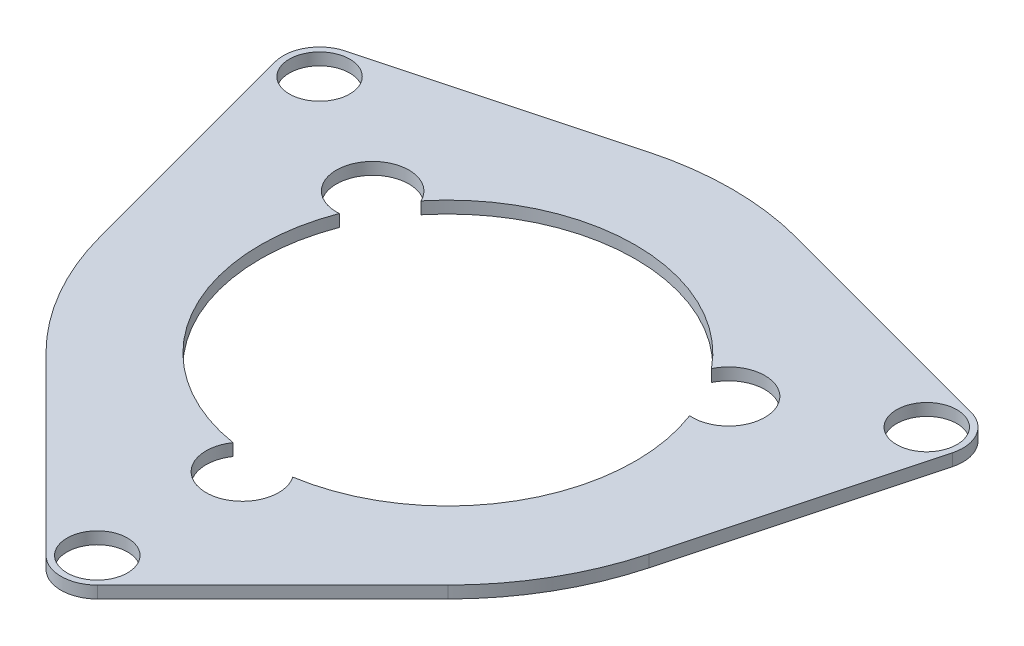
ISO-10303-21;
HEADER;
FILE_DESCRIPTION(('STEP AP214'),'2;1');
FILE_NAME('part.step','',(''),(''),'','','');
FILE_SCHEMA(('AUTOMOTIVE_DESIGN { 1 0 10303 214 1 1 1 1 }'));
ENDSEC;
DATA;
#1=APPLICATION_CONTEXT('core data for automotive mechanical design processes');
#2=APPLICATION_PROTOCOL_DEFINITION('international standard','automotive_design',2000,#1);
#3=PRODUCT_CONTEXT('',#1,'mechanical');
#4=PRODUCT('Part','Part','',(#3));
#5=PRODUCT_RELATED_PRODUCT_CATEGORY('part','',(#4));
#6=PRODUCT_DEFINITION_FORMATION('','',#4);
#7=PRODUCT_DEFINITION_CONTEXT('part definition',#1,'design');
#8=PRODUCT_DEFINITION('design','',#6,#7);
#9=PRODUCT_DEFINITION_SHAPE('','',#8);
#10=(LENGTH_UNIT() NAMED_UNIT(*) SI_UNIT(.MILLI.,.METRE.));
#11=(NAMED_UNIT(*) PLANE_ANGLE_UNIT() SI_UNIT($,.RADIAN.));
#12=(NAMED_UNIT(*) SI_UNIT($,.STERADIAN.) SOLID_ANGLE_UNIT());
#13=UNCERTAINTY_MEASURE_WITH_UNIT(LENGTH_MEASURE(1.E-05),#10,'distance_accuracy_value','');
#14=(GEOMETRIC_REPRESENTATION_CONTEXT(3) GLOBAL_UNCERTAINTY_ASSIGNED_CONTEXT((#13)) GLOBAL_UNIT_ASSIGNED_CONTEXT((#10,
#11,#12)) REPRESENTATION_CONTEXT('',''));
#15=CARTESIAN_POINT('',(0.,0.,0.));
#16=DIRECTION('',(0.,0.,1.));
#17=DIRECTION('',(1.,0.,0.));
#18=AXIS2_PLACEMENT_3D('',#15,#16,#17);
#19=CARTESIAN_POINT('',(0.,0.5,0.));
#20=DIRECTION('',(0.,-1.,0.));
#21=DIRECTION('',(0.,0.,-1.));
#22=AXIS2_PLACEMENT_3D('',#19,#20,#21);
#23=PLANE('',#22);
#24=CARTESIAN_POINT('',(0.,0.5,14.4999999999999));
#25=DIRECTION('',(0.,1.,0.));
#26=DIRECTION('',(0.,0.,1.));
#27=AXIS2_PLACEMENT_3D('',#24,#25,#26);
#28=CIRCLE('',#27,1.25);
#29=CARTESIAN_POINT('',(0.,0.5,15.7499999999999));
#30=VERTEX_POINT('',#29);
#31=EDGE_CURVE('E206',#30,#30,#28,.T.);
#32=ORIENTED_EDGE('',*,*,#31,.F.);
#33=EDGE_LOOP('',(#32));
#34=FACE_BOUND('',#33,.T.);
#35=CARTESIAN_POINT('',(-12.5573683548744,0.5,-7.24999999999988));
#36=DIRECTION('',(0.,1.,0.));
#37=DIRECTION('',(0.,0.,1.));
#38=AXIS2_PLACEMENT_3D('',#35,#36,#37);
#39=CIRCLE('',#38,1.25);
#40=CARTESIAN_POINT('',(-12.5573683548744,0.5,-5.99999999999989));
#41=VERTEX_POINT('',#40);
#42=EDGE_CURVE('E218',#41,#41,#39,.T.);
#43=ORIENTED_EDGE('',*,*,#42,.F.);
#44=EDGE_LOOP('',(#43));
#45=FACE_BOUND('',#44,.T.);
#46=CARTESIAN_POINT('',(0.,0.5,0.));
#47=DIRECTION('',(0.,1.,0.));
#48=DIRECTION('',(0.,0.,-1.));
#49=AXIS2_PLACEMENT_3D('',#46,#47,#48);
#50=CIRCLE('',#49,11.753048327205);
#51=CARTESIAN_POINT('',(3.0419127450911,0.5,-11.3525729168708));
#52=VERTEX_POINT('',#51);
#53=CARTESIAN_POINT('',(-3.0419127450911,0.5,-11.3525729168708));
#54=VERTEX_POINT('',#53);
#55=EDGE_CURVE('E224',#52,#54,#50,.T.);
#56=ORIENTED_EDGE('',*,*,#55,.T.);
#57=DIRECTION('',(-0.965925826289065,0.,0.258819045102533));
#58=VECTOR('',#57,1.);
#59=CARTESIAN_POINT('',(-3.0419127450911,0.5,-11.3525729168708));
#60=LINE('',#59,#58);
#61=CARTESIAN_POINT('',(-12.9455969225282,0.5,-8.69888873943348));
#62=VERTEX_POINT('',#61);
#63=EDGE_CURVE('E227',#54,#62,#60,.T.);
#64=ORIENTED_EDGE('',*,*,#63,.T.);
#65=CARTESIAN_POINT('',(-12.5573683548744,0.5,-7.24999999999988));
#66=DIRECTION('',(0.,1.,0.));
#67=DIRECTION('',(0.,0.,-1.));
#68=AXIS2_PLACEMENT_3D('',#65,#66,#67);
#69=CIRCLE('',#68,1.5);
#70=CARTESIAN_POINT('',(-14.006257094308,0.5,-6.86177143234609));
#71=VERTEX_POINT('',#70);
#72=EDGE_CURVE('E230',#62,#71,#69,.T.);
#73=ORIENTED_EDGE('',*,*,#72,.T.);
#74=DIRECTION('',(0.258819045102528,0.,0.965925826289066));
#75=VECTOR('',#74,1.);
#76=CARTESIAN_POINT('',(-11.3525729168708,0.5,3.04191274509105));
#77=LINE('',#76,#75);
#78=CARTESIAN_POINT('',(-11.3525729168708,0.5,3.04191274509105));
#79=VERTEX_POINT('',#78);
#80=EDGE_CURVE('E232',#71,#79,#77,.T.);
#81=ORIENTED_EDGE('',*,*,#80,.T.);
#82=CARTESIAN_POINT('',(0.,0.5,0.));
#83=DIRECTION('',(0.,1.,0.));
#84=DIRECTION('',(0.,0.,1.));
#85=AXIS2_PLACEMENT_3D('',#82,#83,#84);
#86=CIRCLE('',#85,11.753048327205);
#87=CARTESIAN_POINT('',(-8.31066017177983,0.5,8.31066017177985));
#88=VERTEX_POINT('',#87);
#89=EDGE_CURVE('E234',#79,#88,#86,.T.);
#90=ORIENTED_EDGE('',*,*,#89,.T.);
#91=DIRECTION('',(0.707106781186549,0.,0.707106781186546));
#92=VECTOR('',#91,1.);
#93=CARTESIAN_POINT('',(-8.31066017177982,0.5,8.31066017177985));
#94=LINE('',#93,#92);
#95=CARTESIAN_POINT('',(-1.06066017177982,0.5,15.5606601717798));
#96=VERTEX_POINT('',#95);
#97=EDGE_CURVE('E236',#88,#96,#94,.T.);
#98=ORIENTED_EDGE('',*,*,#97,.T.);
#99=CARTESIAN_POINT('',(0.,0.5,14.4999999999999));
#100=DIRECTION('',(0.,1.,0.));
#101=DIRECTION('',(0.,0.,1.));
#102=AXIS2_PLACEMENT_3D('',#99,#100,#101);
#103=CIRCLE('',#102,1.50000000000005);
#104=CARTESIAN_POINT('',(1.06066017177982,0.5,15.5606601717798));
#105=VERTEX_POINT('',#104);
#106=EDGE_CURVE('E238',#96,#105,#103,.T.);
#107=ORIENTED_EDGE('',*,*,#106,.T.);
#108=DIRECTION('',(0.707106781186548,0.,-0.707106781186547));
#109=VECTOR('',#108,1.);
#110=CARTESIAN_POINT('',(8.31066017177982,0.5,8.31066017177985));
#111=LINE('',#110,#109);
#112=CARTESIAN_POINT('',(8.31066017177982,0.5,8.31066017177985));
#113=VERTEX_POINT('',#112);
#114=EDGE_CURVE('E240',#105,#113,#111,.T.);
#115=ORIENTED_EDGE('',*,*,#114,.T.);
#116=CARTESIAN_POINT('',(0.,0.5,0.));
#117=DIRECTION('',(0.,1.,0.));
#118=DIRECTION('',(0.,0.,-1.));
#119=AXIS2_PLACEMENT_3D('',#116,#117,#118);
#120=CIRCLE('',#119,11.753048327205);
#121=CARTESIAN_POINT('',(11.3525729168708,0.5,3.04191274509105));
#122=VERTEX_POINT('',#121);
#123=EDGE_CURVE('E242',#113,#122,#120,.T.);
#124=ORIENTED_EDGE('',*,*,#123,.T.);
#125=DIRECTION('',(0.258819045102527,0.,-0.965925826289067));
#126=VECTOR('',#125,1.);
#127=CARTESIAN_POINT('',(11.3525729168708,0.5,3.04191274509105));
#128=LINE('',#127,#126);
#129=CARTESIAN_POINT('',(14.006257094308,0.5,-6.8617714323461));
#130=VERTEX_POINT('',#129);
#131=EDGE_CURVE('E244',#122,#130,#128,.T.);
#132=ORIENTED_EDGE('',*,*,#131,.T.);
#133=CARTESIAN_POINT('',(12.5573683548744,0.5,-7.24999999999991));
#134=DIRECTION('',(0.,1.,0.));
#135=DIRECTION('',(0.,0.,-1.));
#136=AXIS2_PLACEMENT_3D('',#133,#134,#135);
#137=CIRCLE('',#136,1.49999999999999);
#138=CARTESIAN_POINT('',(12.9455969225282,0.5,-8.69888873943349));
#139=VERTEX_POINT('',#138);
#140=EDGE_CURVE('E246',#130,#139,#137,.T.);
#141=ORIENTED_EDGE('',*,*,#140,.T.);
#142=DIRECTION('',(-0.965925826289065,0.,-0.258819045102532));
#143=VECTOR('',#142,1.);
#144=CARTESIAN_POINT('',(3.0419127450911,0.5,-11.3525729168708));
#145=LINE('',#144,#143);
#146=EDGE_CURVE('E248',#139,#52,#145,.T.);
#147=ORIENTED_EDGE('',*,*,#146,.T.);
#148=EDGE_LOOP('',(#56,#64,#73,#81,#90,#98,#107,#115,#124,#132,#141,#147));
#149=FACE_BOUND('',#148,.T.);
#150=CARTESIAN_POINT('',(12.5573683548744,0.5,-7.24999999999991));
#151=DIRECTION('',(0.,1.,0.));
#152=DIRECTION('',(0.,0.,1.));
#153=AXIS2_PLACEMENT_3D('',#150,#151,#152);
#154=CIRCLE('',#153,1.25);
#155=CARTESIAN_POINT('',(12.5573683548744,0.5,-5.99999999999991));
#156=VERTEX_POINT('',#155);
#157=EDGE_CURVE('E212',#156,#156,#154,.T.);
#158=ORIENTED_EDGE('',*,*,#157,.F.);
#159=EDGE_LOOP('',(#158));
#160=FACE_BOUND('',#159,.T.);
#161=CARTESIAN_POINT('',(0.,0.5,0.));
#162=DIRECTION('',(0.,1.,0.));
#163=DIRECTION('',(0.,0.,-1.));
#164=AXIS2_PLACEMENT_3D('',#161,#162,#163);
#165=CIRCLE('',#164,7.75);
#166=CARTESIAN_POINT('',(6.00751808071081,0.5,-4.89614404505553));
#167=VERTEX_POINT('',#166);
#168=CARTESIAN_POINT('',(-6.00751808071081,0.5,-4.89614404505553));
#169=VERTEX_POINT('',#168);
#170=EDGE_CURVE('E155',#167,#169,#165,.T.);
#171=ORIENTED_EDGE('',*,*,#170,.F.);
#172=CARTESIAN_POINT('',(7.36121593216777,0.5,-4.24999999999993));
#173=DIRECTION('',(0.,1.,0.));
#174=DIRECTION('',(0.,0.,-1.));
#175=AXIS2_PLACEMENT_3D('',#172,#173,#174);
#176=CIRCLE('',#175,1.5);
#177=CARTESIAN_POINT('',(7.24394416396144,0.5,-2.754591249062));
#178=VERTEX_POINT('',#177);
#179=EDGE_CURVE('E184',#178,#167,#176,.T.);
#180=ORIENTED_EDGE('',*,*,#179,.F.);
#181=CARTESIAN_POINT('',(0.,0.5,0.));
#182=DIRECTION('',(0.,1.,0.));
#183=DIRECTION('',(0.,0.,-1.));
#184=AXIS2_PLACEMENT_3D('',#181,#182,#183);
#185=CIRCLE('',#184,7.75);
#186=CARTESIAN_POINT('',(1.23642608325066,0.5,7.65073529411765));
#187=VERTEX_POINT('',#186);
#188=EDGE_CURVE('E182',#187,#178,#185,.T.);
#189=ORIENTED_EDGE('',*,*,#188,.F.);
#190=CARTESIAN_POINT('',(0.,0.5,8.5));
#191=DIRECTION('',(0.,1.,0.));
#192=DIRECTION('',(0.,0.,-1.));
#193=AXIS2_PLACEMENT_3D('',#190,#191,#192);
#194=CIRCLE('',#193,1.5);
#195=CARTESIAN_POINT('',(-1.23642608325065,0.5,7.65073529411765));
#196=VERTEX_POINT('',#195);
#197=EDGE_CURVE('E178',#196,#187,#194,.T.);
#198=ORIENTED_EDGE('',*,*,#197,.F.);
#199=CARTESIAN_POINT('',(0.,0.5,0.));
#200=DIRECTION('',(0.,1.,0.));
#201=DIRECTION('',(0.,0.,-1.));
#202=AXIS2_PLACEMENT_3D('',#199,#200,#201);
#203=CIRCLE('',#202,7.75);
#204=CARTESIAN_POINT('',(-7.24394416396144,0.5,-2.75459124906199));
#205=VERTEX_POINT('',#204);
#206=EDGE_CURVE('E176',#205,#196,#203,.T.);
#207=ORIENTED_EDGE('',*,*,#206,.F.);
#208=CARTESIAN_POINT('',(-7.36121593216777,0.5,-4.24999999999993));
#209=DIRECTION('',(0.,1.,0.));
#210=DIRECTION('',(0.,0.,-1.));
#211=AXIS2_PLACEMENT_3D('',#208,#209,#210);
#212=CIRCLE('',#211,1.5);
#213=EDGE_CURVE('E163',#169,#205,#212,.T.);
#214=ORIENTED_EDGE('',*,*,#213,.F.);
#215=EDGE_LOOP('',(#171,#180,#189,#198,#207,#214));
#216=FACE_BOUND('',#215,.T.);
#217=ADVANCED_FACE('F30',(#34,#45,#149,#160,#216),#23,.F.);
#218=CARTESIAN_POINT('',(0.,0.,0.));
#219=DIRECTION('',(0.,-1.,0.));
#220=DIRECTION('',(0.,0.,-1.));
#221=AXIS2_PLACEMENT_3D('',#218,#219,#220);
#222=PLANE('',#221);
#223=CARTESIAN_POINT('',(0.,0.,14.4999999999999));
#224=DIRECTION('',(0.,1.,0.));
#225=DIRECTION('',(0.,0.,1.));
#226=AXIS2_PLACEMENT_3D('',#223,#224,#225);
#227=CIRCLE('',#226,1.25);
#228=CARTESIAN_POINT('',(0.,0.,15.7499999999999));
#229=VERTEX_POINT('',#228);
#230=EDGE_CURVE('E171',#229,#229,#227,.T.);
#231=ORIENTED_EDGE('',*,*,#230,.T.);
#232=EDGE_LOOP('',(#231));
#233=FACE_BOUND('',#232,.T.);
#234=CARTESIAN_POINT('',(-12.5573683548744,0.,-7.24999999999988));
#235=DIRECTION('',(0.,1.,0.));
#236=DIRECTION('',(0.,0.,1.));
#237=AXIS2_PLACEMENT_3D('',#234,#235,#236);
#238=CIRCLE('',#237,1.25);
#239=CARTESIAN_POINT('',(-12.5573683548744,0.,-5.99999999999989));
#240=VERTEX_POINT('',#239);
#241=EDGE_CURVE('E215',#240,#240,#238,.T.);
#242=ORIENTED_EDGE('',*,*,#241,.T.);
#243=EDGE_LOOP('',(#242));
#244=FACE_BOUND('',#243,.T.);
#245=CARTESIAN_POINT('',(0.,0.,0.));
#246=DIRECTION('',(0.,1.,0.));
#247=DIRECTION('',(0.,0.,-1.));
#248=AXIS2_PLACEMENT_3D('',#245,#246,#247);
#249=CIRCLE('',#248,11.753048327205);
#250=CARTESIAN_POINT('',(3.0419127450911,0.,-11.3525729168708));
#251=VERTEX_POINT('',#250);
#252=CARTESIAN_POINT('',(-3.0419127450911,0.,-11.3525729168708));
#253=VERTEX_POINT('',#252);
#254=EDGE_CURVE('E221',#251,#253,#249,.T.);
#255=ORIENTED_EDGE('',*,*,#254,.F.);
#256=DIRECTION('',(-0.965925826289065,0.,-0.258819045102532));
#257=VECTOR('',#256,1.);
#258=CARTESIAN_POINT('',(3.0419127450911,0.,-11.3525729168708));
#259=LINE('',#258,#257);
#260=CARTESIAN_POINT('',(12.9455969225282,0.,-8.69888873943349));
#261=VERTEX_POINT('',#260);
#262=EDGE_CURVE('E228',#261,#251,#259,.T.);
#263=ORIENTED_EDGE('',*,*,#262,.F.);
#264=CARTESIAN_POINT('',(12.5573683548744,0.,-7.24999999999991));
#265=DIRECTION('',(0.,1.,0.));
#266=DIRECTION('',(0.,0.,-1.));
#267=AXIS2_PLACEMENT_3D('',#264,#265,#266);
#268=CIRCLE('',#267,1.49999999999999);
#269=CARTESIAN_POINT('',(14.006257094308,0.,-6.8617714323461));
#270=VERTEX_POINT('',#269);
#271=EDGE_CURVE('E271',#270,#261,#268,.T.);
#272=ORIENTED_EDGE('',*,*,#271,.F.);
#273=DIRECTION('',(0.258819045102527,0.,-0.965925826289067));
#274=VECTOR('',#273,1.);
#275=CARTESIAN_POINT('',(11.3525729168708,0.,3.04191274509105));
#276=LINE('',#275,#274);
#277=CARTESIAN_POINT('',(11.3525729168708,0.,3.04191274509105));
#278=VERTEX_POINT('',#277);
#279=EDGE_CURVE('E269',#278,#270,#276,.T.);
#280=ORIENTED_EDGE('',*,*,#279,.F.);
#281=CARTESIAN_POINT('',(0.,0.,0.));
#282=DIRECTION('',(0.,1.,0.));
#283=DIRECTION('',(0.,0.,-1.));
#284=AXIS2_PLACEMENT_3D('',#281,#282,#283);
#285=CIRCLE('',#284,11.753048327205);
#286=CARTESIAN_POINT('',(8.31066017177982,0.,8.31066017177985));
#287=VERTEX_POINT('',#286);
#288=EDGE_CURVE('E267',#287,#278,#285,.T.);
#289=ORIENTED_EDGE('',*,*,#288,.F.);
#290=DIRECTION('',(0.707106781186548,0.,-0.707106781186547));
#291=VECTOR('',#290,1.);
#292=CARTESIAN_POINT('',(8.31066017177982,0.,8.31066017177985));
#293=LINE('',#292,#291);
#294=CARTESIAN_POINT('',(1.06066017177982,0.,15.5606601717798));
#295=VERTEX_POINT('',#294);
#296=EDGE_CURVE('E265',#295,#287,#293,.T.);
#297=ORIENTED_EDGE('',*,*,#296,.F.);
#298=CARTESIAN_POINT('',(0.,0.,14.4999999999999));
#299=DIRECTION('',(0.,1.,0.));
#300=DIRECTION('',(0.,0.,1.));
#301=AXIS2_PLACEMENT_3D('',#298,#299,#300);
#302=CIRCLE('',#301,1.50000000000005);
#303=CARTESIAN_POINT('',(-1.06066017177982,0.,15.5606601717798));
#304=VERTEX_POINT('',#303);
#305=EDGE_CURVE('E263',#304,#295,#302,.T.);
#306=ORIENTED_EDGE('',*,*,#305,.F.);
#307=DIRECTION('',(0.707106781186549,0.,0.707106781186546));
#308=VECTOR('',#307,1.);
#309=CARTESIAN_POINT('',(-8.31066017177982,0.,8.31066017177985));
#310=LINE('',#309,#308);
#311=CARTESIAN_POINT('',(-8.31066017177983,0.,8.31066017177985));
#312=VERTEX_POINT('',#311);
#313=EDGE_CURVE('E261',#312,#304,#310,.T.);
#314=ORIENTED_EDGE('',*,*,#313,.F.);
#315=CARTESIAN_POINT('',(0.,0.,0.));
#316=DIRECTION('',(0.,1.,0.));
#317=DIRECTION('',(0.,0.,1.));
#318=AXIS2_PLACEMENT_3D('',#315,#316,#317);
#319=CIRCLE('',#318,11.753048327205);
#320=CARTESIAN_POINT('',(-11.3525729168708,0.,3.04191274509105));
#321=VERTEX_POINT('',#320);
#322=EDGE_CURVE('E259',#321,#312,#319,.T.);
#323=ORIENTED_EDGE('',*,*,#322,.F.);
#324=DIRECTION('',(0.258819045102528,0.,0.965925826289066));
#325=VECTOR('',#324,1.);
#326=CARTESIAN_POINT('',(-11.3525729168708,0.,3.04191274509105));
#327=LINE('',#326,#325);
#328=CARTESIAN_POINT('',(-14.006257094308,0.,-6.86177143234609));
#329=VERTEX_POINT('',#328);
#330=EDGE_CURVE('E257',#329,#321,#327,.T.);
#331=ORIENTED_EDGE('',*,*,#330,.F.);
#332=CARTESIAN_POINT('',(-12.5573683548744,0.,-7.24999999999988));
#333=DIRECTION('',(0.,1.,0.));
#334=DIRECTION('',(0.,0.,-1.));
#335=AXIS2_PLACEMENT_3D('',#332,#333,#334);
#336=CIRCLE('',#335,1.5);
#337=CARTESIAN_POINT('',(-12.9455969225282,0.,-8.69888873943348));
#338=VERTEX_POINT('',#337);
#339=EDGE_CURVE('E255',#338,#329,#336,.T.);
#340=ORIENTED_EDGE('',*,*,#339,.F.);
#341=DIRECTION('',(-0.965925826289065,0.,0.258819045102533));
#342=VECTOR('',#341,1.);
#343=CARTESIAN_POINT('',(-3.0419127450911,0.,-11.3525729168708));
#344=LINE('',#343,#342);
#345=EDGE_CURVE('E253',#253,#338,#344,.T.);
#346=ORIENTED_EDGE('',*,*,#345,.F.);
#347=EDGE_LOOP('',(#255,#263,#272,#280,#289,#297,#306,#314,#323,#331,#340,#346));
#348=FACE_BOUND('',#347,.T.);
#349=CARTESIAN_POINT('',(12.5573683548744,0.,-7.24999999999991));
#350=DIRECTION('',(0.,1.,0.));
#351=DIRECTION('',(0.,0.,1.));
#352=AXIS2_PLACEMENT_3D('',#349,#350,#351);
#353=CIRCLE('',#352,1.25);
#354=CARTESIAN_POINT('',(12.5573683548744,0.,-5.99999999999991));
#355=VERTEX_POINT('',#354);
#356=EDGE_CURVE('E209',#355,#355,#353,.T.);
#357=ORIENTED_EDGE('',*,*,#356,.T.);
#358=EDGE_LOOP('',(#357));
#359=FACE_BOUND('',#358,.T.);
#360=CARTESIAN_POINT('',(7.36121593216777,0.,-4.24999999999993));
#361=DIRECTION('',(0.,1.,0.));
#362=DIRECTION('',(0.,0.,-1.));
#363=AXIS2_PLACEMENT_3D('',#360,#361,#362);
#364=CIRCLE('',#363,1.5);
#365=CARTESIAN_POINT('',(7.24394416396144,0.,-2.754591249062));
#366=VERTEX_POINT('',#365);
#367=CARTESIAN_POINT('',(6.00751808071081,0.,-4.89614404505553));
#368=VERTEX_POINT('',#367);
#369=EDGE_CURVE('E164',#366,#368,#364,.T.);
#370=ORIENTED_EDGE('',*,*,#369,.T.);
#371=CARTESIAN_POINT('',(0.,0.,0.));
#372=DIRECTION('',(0.,1.,0.));
#373=DIRECTION('',(0.,0.,-1.));
#374=AXIS2_PLACEMENT_3D('',#371,#372,#373);
#375=CIRCLE('',#374,7.75);
#376=CARTESIAN_POINT('',(-6.00751808071081,0.,-4.89614404505553));
#377=VERTEX_POINT('',#376);
#378=EDGE_CURVE('E53',#368,#377,#375,.T.);
#379=ORIENTED_EDGE('',*,*,#378,.T.);
#380=CARTESIAN_POINT('',(-7.36121593216777,0.,-4.24999999999993));
#381=DIRECTION('',(0.,1.,0.));
#382=DIRECTION('',(0.,0.,-1.));
#383=AXIS2_PLACEMENT_3D('',#380,#381,#382);
#384=CIRCLE('',#383,1.5);
#385=CARTESIAN_POINT('',(-7.24394416396144,0.,-2.75459124906199));
#386=VERTEX_POINT('',#385);
#387=EDGE_CURVE('E170',#377,#386,#384,.T.);
#388=ORIENTED_EDGE('',*,*,#387,.T.);
#389=CARTESIAN_POINT('',(0.,0.,0.));
#390=DIRECTION('',(0.,1.,0.));
#391=DIRECTION('',(0.,0.,-1.));
#392=AXIS2_PLACEMENT_3D('',#389,#390,#391);
#393=CIRCLE('',#392,7.75);
#394=CARTESIAN_POINT('',(-1.23642608325065,0.,7.65073529411765));
#395=VERTEX_POINT('',#394);
#396=EDGE_CURVE('E188',#386,#395,#393,.T.);
#397=ORIENTED_EDGE('',*,*,#396,.T.);
#398=CARTESIAN_POINT('',(0.,0.,8.5));
#399=DIRECTION('',(0.,1.,0.));
#400=DIRECTION('',(0.,0.,-1.));
#401=AXIS2_PLACEMENT_3D('',#398,#399,#400);
#402=CIRCLE('',#401,1.5);
#403=CARTESIAN_POINT('',(1.23642608325066,0.,7.65073529411765));
#404=VERTEX_POINT('',#403);
#405=EDGE_CURVE('E191',#395,#404,#402,.T.);
#406=ORIENTED_EDGE('',*,*,#405,.T.);
#407=CARTESIAN_POINT('',(0.,0.,0.));
#408=DIRECTION('',(0.,1.,0.));
#409=DIRECTION('',(0.,0.,-1.));
#410=AXIS2_PLACEMENT_3D('',#407,#408,#409);
#411=CIRCLE('',#410,7.75);
#412=EDGE_CURVE('E194',#404,#366,#411,.T.);
#413=ORIENTED_EDGE('',*,*,#412,.T.);
#414=EDGE_LOOP('',(#370,#379,#388,#397,#406,#413));
#415=FACE_BOUND('',#414,.T.);
#416=ADVANCED_FACE('F313',(#233,#244,#348,#359,#415),#222,.T.);
#417=CARTESIAN_POINT('',(0.,0.5,0.));
#418=DIRECTION('',(0.,-1.,0.));
#419=DIRECTION('',(0.,0.,-1.));
#420=AXIS2_PLACEMENT_3D('',#417,#418,#419);
#421=CYLINDRICAL_SURFACE('',#420,11.753048327205);
#422=ORIENTED_EDGE('',*,*,#254,.T.);
#423=DIRECTION('',(0.,-1.,0.));
#424=VECTOR('',#423,1.);
#425=CARTESIAN_POINT('',(-3.0419127450911,0.5,-11.3525729168708));
#426=LINE('',#425,#424);
#427=EDGE_CURVE('E11',#54,#253,#426,.T.);
#428=ORIENTED_EDGE('',*,*,#427,.F.);
#429=ORIENTED_EDGE('',*,*,#55,.F.);
#430=DIRECTION('',(0.,-1.,0.));
#431=VECTOR('',#430,1.);
#432=CARTESIAN_POINT('',(3.0419127450911,0.5,-11.3525729168708));
#433=LINE('',#432,#431);
#434=EDGE_CURVE('E250',#52,#251,#433,.T.);
#435=ORIENTED_EDGE('',*,*,#434,.T.);
#436=EDGE_LOOP('',(#422,#428,#429,#435));
#437=FACE_BOUND('',#436,.T.);
#438=ADVANCED_FACE('F32',(#437),#421,.T.);
#439=CARTESIAN_POINT('',(-3.0419127450911,0.5,-11.3525729168708));
#440=DIRECTION('',(0.258819045102533,0.,0.965925826289065));
#441=DIRECTION('',(0.965925826289065,0.,-0.258819045102533));
#442=AXIS2_PLACEMENT_3D('',#439,#440,#441);
#443=PLANE('',#442);
#444=ORIENTED_EDGE('',*,*,#345,.T.);
#445=DIRECTION('',(0.,-1.,0.));
#446=VECTOR('',#445,1.);
#447=CARTESIAN_POINT('',(-12.9455969225282,0.5,-8.69888873943348));
#448=LINE('',#447,#446);
#449=EDGE_CURVE('E38',#62,#338,#448,.T.);
#450=ORIENTED_EDGE('',*,*,#449,.F.);
#451=ORIENTED_EDGE('',*,*,#63,.F.);
#452=ORIENTED_EDGE('',*,*,#427,.T.);
#453=EDGE_LOOP('',(#444,#450,#451,#452));
#454=FACE_BOUND('',#453,.T.);
#455=ADVANCED_FACE('F331',(#454),#443,.F.);
#456=CARTESIAN_POINT('',(-12.5573683548744,0.5,-7.24999999999988));
#457=DIRECTION('',(0.,-1.,0.));
#458=DIRECTION('',(0.,0.,-1.));
#459=AXIS2_PLACEMENT_3D('',#456,#457,#458);
#460=CYLINDRICAL_SURFACE('',#459,1.5);
#461=ORIENTED_EDGE('',*,*,#339,.T.);
#462=DIRECTION('',(0.,-1.,0.));
#463=VECTOR('',#462,1.);
#464=CARTESIAN_POINT('',(-14.006257094308,0.5,-6.86177143234609));
#465=LINE('',#464,#463);
#466=EDGE_CURVE('E300',#71,#329,#465,.T.);
#467=ORIENTED_EDGE('',*,*,#466,.F.);
#468=ORIENTED_EDGE('',*,*,#72,.F.);
#469=ORIENTED_EDGE('',*,*,#449,.T.);
#470=EDGE_LOOP('',(#461,#467,#468,#469));
#471=FACE_BOUND('',#470,.T.);
#472=ADVANCED_FACE('F307',(#471),#460,.T.);
#473=CARTESIAN_POINT('',(-11.3525729168708,0.5,3.04191274509105));
#474=DIRECTION('',(0.965925826289067,0.,-0.258819045102528));
#475=DIRECTION('',(-0.258819045102528,0.,-0.965925826289067));
#476=AXIS2_PLACEMENT_3D('',#473,#474,#475);
#477=PLANE('',#476);
#478=ORIENTED_EDGE('',*,*,#330,.T.);
#479=DIRECTION('',(0.,-1.,0.));
#480=VECTOR('',#479,1.);
#481=CARTESIAN_POINT('',(-11.3525729168708,0.5,3.04191274509105));
#482=LINE('',#481,#480);
#483=EDGE_CURVE('E297',#79,#321,#482,.T.);
#484=ORIENTED_EDGE('',*,*,#483,.F.);
#485=ORIENTED_EDGE('',*,*,#80,.F.);
#486=ORIENTED_EDGE('',*,*,#466,.T.);
#487=EDGE_LOOP('',(#478,#484,#485,#486));
#488=FACE_BOUND('',#487,.T.);
#489=ADVANCED_FACE('F319',(#488),#477,.F.);
#490=CARTESIAN_POINT('',(0.,0.5,0.));
#491=DIRECTION('',(0.,-1.,0.));
#492=DIRECTION('',(0.,0.,-1.));
#493=AXIS2_PLACEMENT_3D('',#490,#491,#492);
#494=CYLINDRICAL_SURFACE('',#493,11.753048327205);
#495=ORIENTED_EDGE('',*,*,#322,.T.);
#496=DIRECTION('',(0.,-1.,0.));
#497=VECTOR('',#496,1.);
#498=CARTESIAN_POINT('',(-8.31066017177983,0.5,8.31066017177985));
#499=LINE('',#498,#497);
#500=EDGE_CURVE('E294',#88,#312,#499,.T.);
#501=ORIENTED_EDGE('',*,*,#500,.F.);
#502=ORIENTED_EDGE('',*,*,#89,.F.);
#503=ORIENTED_EDGE('',*,*,#483,.T.);
#504=EDGE_LOOP('',(#495,#501,#502,#503));
#505=FACE_BOUND('',#504,.T.);
#506=ADVANCED_FACE('F323',(#505),#494,.T.);
#507=CARTESIAN_POINT('',(-8.31066017177982,0.5,8.31066017177985));
#508=DIRECTION('',(0.707106781186546,0.,-0.707106781186549));
#509=DIRECTION('',(-0.707106781186549,0.,-0.707106781186546));
#510=AXIS2_PLACEMENT_3D('',#507,#508,#509);
#511=PLANE('',#510);
#512=ORIENTED_EDGE('',*,*,#313,.T.);
#513=DIRECTION('',(0.,-1.,0.));
#514=VECTOR('',#513,1.);
#515=CARTESIAN_POINT('',(-1.06066017177982,0.5,15.5606601717798));
#516=LINE('',#515,#514);
#517=EDGE_CURVE('E291',#96,#304,#516,.T.);
#518=ORIENTED_EDGE('',*,*,#517,.F.);
#519=ORIENTED_EDGE('',*,*,#97,.F.);
#520=ORIENTED_EDGE('',*,*,#500,.T.);
#521=EDGE_LOOP('',(#512,#518,#519,#520));
#522=FACE_BOUND('',#521,.T.);
#523=ADVANCED_FACE('F364',(#522),#511,.F.);
#524=CARTESIAN_POINT('',(0.,0.5,14.4999999999999));
#525=DIRECTION('',(0.,-1.,0.));
#526=DIRECTION('',(0.,0.,-1.));
#527=AXIS2_PLACEMENT_3D('',#524,#525,#526);
#528=CYLINDRICAL_SURFACE('',#527,1.50000000000005);
#529=ORIENTED_EDGE('',*,*,#305,.T.);
#530=DIRECTION('',(0.,-1.,0.));
#531=VECTOR('',#530,1.);
#532=CARTESIAN_POINT('',(1.06066017177982,0.5,15.5606601717798));
#533=LINE('',#532,#531);
#534=EDGE_CURVE('E288',#105,#295,#533,.T.);
#535=ORIENTED_EDGE('',*,*,#534,.F.);
#536=ORIENTED_EDGE('',*,*,#106,.F.);
#537=ORIENTED_EDGE('',*,*,#517,.T.);
#538=EDGE_LOOP('',(#529,#535,#536,#537));
#539=FACE_BOUND('',#538,.T.);
#540=ADVANCED_FACE('F362',(#539),#528,.T.);
#541=CARTESIAN_POINT('',(8.31066017177982,0.5,8.31066017177985));
#542=DIRECTION('',(-0.707106781186547,0.,-0.707106781186548));
#543=DIRECTION('',(-0.707106781186548,0.,0.707106781186547));
#544=AXIS2_PLACEMENT_3D('',#541,#542,#543);
#545=PLANE('',#544);
#546=ORIENTED_EDGE('',*,*,#296,.T.);
#547=DIRECTION('',(0.,-1.,0.));
#548=VECTOR('',#547,1.);
#549=CARTESIAN_POINT('',(8.31066017177982,0.5,8.31066017177985));
#550=LINE('',#549,#548);
#551=EDGE_CURVE('E285',#113,#287,#550,.T.);
#552=ORIENTED_EDGE('',*,*,#551,.F.);
#553=ORIENTED_EDGE('',*,*,#114,.F.);
#554=ORIENTED_EDGE('',*,*,#534,.T.);
#555=EDGE_LOOP('',(#546,#552,#553,#554));
#556=FACE_BOUND('',#555,.T.);
#557=ADVANCED_FACE('F358',(#556),#545,.F.);
#558=CARTESIAN_POINT('',(0.,0.5,0.));
#559=DIRECTION('',(0.,-1.,0.));
#560=DIRECTION('',(0.,0.,-1.));
#561=AXIS2_PLACEMENT_3D('',#558,#559,#560);
#562=CYLINDRICAL_SURFACE('',#561,11.753048327205);
#563=ORIENTED_EDGE('',*,*,#288,.T.);
#564=DIRECTION('',(0.,-1.,0.));
#565=VECTOR('',#564,1.);
#566=CARTESIAN_POINT('',(11.3525729168708,0.5,3.04191274509105));
#567=LINE('',#566,#565);
#568=EDGE_CURVE('E282',#122,#278,#567,.T.);
#569=ORIENTED_EDGE('',*,*,#568,.F.);
#570=ORIENTED_EDGE('',*,*,#123,.F.);
#571=ORIENTED_EDGE('',*,*,#551,.T.);
#572=EDGE_LOOP('',(#563,#569,#570,#571));
#573=FACE_BOUND('',#572,.T.);
#574=ADVANCED_FACE('F353',(#573),#562,.T.);
#575=CARTESIAN_POINT('',(11.3525729168708,0.5,3.04191274509105));
#576=DIRECTION('',(-0.965925826289066,0.,-0.258819045102527));
#577=DIRECTION('',(-0.258819045102527,0.,0.965925826289067));
#578=AXIS2_PLACEMENT_3D('',#575,#576,#577);
#579=PLANE('',#578);
#580=ORIENTED_EDGE('',*,*,#279,.T.);
#581=DIRECTION('',(0.,-1.,0.));
#582=VECTOR('',#581,1.);
#583=CARTESIAN_POINT('',(14.006257094308,0.5,-6.8617714323461));
#584=LINE('',#583,#582);
#585=EDGE_CURVE('E279',#130,#270,#584,.T.);
#586=ORIENTED_EDGE('',*,*,#585,.F.);
#587=ORIENTED_EDGE('',*,*,#131,.F.);
#588=ORIENTED_EDGE('',*,*,#568,.T.);
#589=EDGE_LOOP('',(#580,#586,#587,#588));
#590=FACE_BOUND('',#589,.T.);
#591=ADVANCED_FACE('F347',(#590),#579,.F.);
#592=CARTESIAN_POINT('',(12.5573683548744,0.5,-7.24999999999991));
#593=DIRECTION('',(0.,-1.,0.));
#594=DIRECTION('',(0.,0.,-1.));
#595=AXIS2_PLACEMENT_3D('',#592,#593,#594);
#596=CYLINDRICAL_SURFACE('',#595,1.49999999999999);
#597=ORIENTED_EDGE('',*,*,#271,.T.);
#598=DIRECTION('',(0.,-1.,0.));
#599=VECTOR('',#598,1.);
#600=CARTESIAN_POINT('',(12.9455969225282,0.5,-8.69888873943349));
#601=LINE('',#600,#599);
#602=EDGE_CURVE('E276',#139,#261,#601,.T.);
#603=ORIENTED_EDGE('',*,*,#602,.F.);
#604=ORIENTED_EDGE('',*,*,#140,.F.);
#605=ORIENTED_EDGE('',*,*,#585,.T.);
#606=EDGE_LOOP('',(#597,#603,#604,#605));
#607=FACE_BOUND('',#606,.T.);
#608=ADVANCED_FACE('F343',(#607),#596,.T.);
#609=CARTESIAN_POINT('',(3.0419127450911,0.5,-11.3525729168708));
#610=DIRECTION('',(-0.258819045102532,0.,0.965925826289065));
#611=DIRECTION('',(0.965925826289065,0.,0.258819045102532));
#612=AXIS2_PLACEMENT_3D('',#609,#610,#611);
#613=PLANE('',#612);
#614=ORIENTED_EDGE('',*,*,#262,.T.);
#615=ORIENTED_EDGE('',*,*,#434,.F.);
#616=ORIENTED_EDGE('',*,*,#146,.F.);
#617=ORIENTED_EDGE('',*,*,#602,.T.);
#618=EDGE_LOOP('',(#614,#615,#616,#617));
#619=FACE_BOUND('',#618,.T.);
#620=ADVANCED_FACE('F338',(#619),#613,.F.);
#621=CARTESIAN_POINT('',(-12.5573683548744,0.5,-7.24999999999988));
#622=DIRECTION('',(0.,-1.,0.));
#623=DIRECTION('',(0.,0.,-1.));
#624=AXIS2_PLACEMENT_3D('',#621,#622,#623);
#625=CYLINDRICAL_SURFACE('',#624,1.25);
#626=ORIENTED_EDGE('',*,*,#42,.T.);
#627=EDGE_LOOP('',(#626));
#628=FACE_BOUND('',#627,.T.);
#629=ORIENTED_EDGE('',*,*,#241,.F.);
#630=EDGE_LOOP('',(#629));
#631=FACE_BOUND('',#630,.T.);
#632=ADVANCED_FACE('F384',(#628,#631),#625,.F.);
#633=CARTESIAN_POINT('',(12.5573683548744,0.5,-7.24999999999991));
#634=DIRECTION('',(0.,-1.,0.));
#635=DIRECTION('',(0.,0.,-1.));
#636=AXIS2_PLACEMENT_3D('',#633,#634,#635);
#637=CYLINDRICAL_SURFACE('',#636,1.25);
#638=ORIENTED_EDGE('',*,*,#157,.T.);
#639=EDGE_LOOP('',(#638));
#640=FACE_BOUND('',#639,.T.);
#641=ORIENTED_EDGE('',*,*,#356,.F.);
#642=EDGE_LOOP('',(#641));
#643=FACE_BOUND('',#642,.T.);
#644=ADVANCED_FACE('F422',(#640,#643),#637,.F.);
#645=CARTESIAN_POINT('',(0.,0.5,14.4999999999999));
#646=DIRECTION('',(0.,-1.,0.));
#647=DIRECTION('',(0.,0.,-1.));
#648=AXIS2_PLACEMENT_3D('',#645,#646,#647);
#649=CYLINDRICAL_SURFACE('',#648,1.25);
#650=ORIENTED_EDGE('',*,*,#31,.T.);
#651=EDGE_LOOP('',(#650));
#652=FACE_BOUND('',#651,.T.);
#653=ORIENTED_EDGE('',*,*,#230,.F.);
#654=EDGE_LOOP('',(#653));
#655=FACE_BOUND('',#654,.T.);
#656=ADVANCED_FACE('F429',(#652,#655),#649,.F.);
#657=CARTESIAN_POINT('',(0.,0.5,0.));
#658=DIRECTION('',(0.,-1.,0.));
#659=DIRECTION('',(0.,0.,-1.));
#660=AXIS2_PLACEMENT_3D('',#657,#658,#659);
#661=CYLINDRICAL_SURFACE('',#660,7.75);
#662=ORIENTED_EDGE('',*,*,#378,.F.);
#663=DIRECTION('',(0.,-1.,0.));
#664=VECTOR('',#663,1.);
#665=CARTESIAN_POINT('',(6.00751808071081,0.5,-4.89614404505553));
#666=LINE('',#665,#664);
#667=EDGE_CURVE('E159',#167,#368,#666,.T.);
#668=ORIENTED_EDGE('',*,*,#667,.F.);
#669=ORIENTED_EDGE('',*,*,#170,.T.);
#670=DIRECTION('',(0.,-1.,0.));
#671=VECTOR('',#670,1.);
#672=CARTESIAN_POINT('',(-6.00751808071081,0.5,-4.89614404505553));
#673=LINE('',#672,#671);
#674=EDGE_CURVE('E158',#169,#377,#673,.T.);
#675=ORIENTED_EDGE('',*,*,#674,.T.);
#676=EDGE_LOOP('',(#662,#668,#669,#675));
#677=FACE_BOUND('',#676,.T.);
#678=ADVANCED_FACE('F157',(#677),#661,.F.);
#679=CARTESIAN_POINT('',(-7.36121593216777,0.5,-4.24999999999993));
#680=DIRECTION('',(0.,-1.,0.));
#681=DIRECTION('',(0.,0.,-1.));
#682=AXIS2_PLACEMENT_3D('',#679,#680,#681);
#683=CYLINDRICAL_SURFACE('',#682,1.5);
#684=ORIENTED_EDGE('',*,*,#387,.F.);
#685=ORIENTED_EDGE('',*,*,#674,.F.);
#686=ORIENTED_EDGE('',*,*,#213,.T.);
#687=DIRECTION('',(0.,-1.,0.));
#688=VECTOR('',#687,1.);
#689=CARTESIAN_POINT('',(-7.24394416396144,0.5,-2.75459124906199));
#690=LINE('',#689,#688);
#691=EDGE_CURVE('E172',#205,#386,#690,.T.);
#692=ORIENTED_EDGE('',*,*,#691,.T.);
#693=EDGE_LOOP('',(#684,#685,#686,#692));
#694=FACE_BOUND('',#693,.T.);
#695=ADVANCED_FACE('F167',(#694),#683,.F.);
#696=CARTESIAN_POINT('',(0.,0.5,0.));
#697=DIRECTION('',(0.,-1.,0.));
#698=DIRECTION('',(0.,0.,-1.));
#699=AXIS2_PLACEMENT_3D('',#696,#697,#698);
#700=CYLINDRICAL_SURFACE('',#699,7.75);
#701=ORIENTED_EDGE('',*,*,#396,.F.);
#702=ORIENTED_EDGE('',*,*,#691,.F.);
#703=ORIENTED_EDGE('',*,*,#206,.T.);
#704=DIRECTION('',(0.,-1.,0.));
#705=VECTOR('',#704,1.);
#706=CARTESIAN_POINT('',(-1.23642608325065,0.5,7.65073529411765));
#707=LINE('',#706,#705);
#708=EDGE_CURVE('E203',#196,#395,#707,.T.);
#709=ORIENTED_EDGE('',*,*,#708,.T.);
#710=EDGE_LOOP('',(#701,#702,#703,#709));
#711=FACE_BOUND('',#710,.T.);
#712=ADVANCED_FACE('F449',(#711),#700,.F.);
#713=CARTESIAN_POINT('',(0.,0.5,8.5));
#714=DIRECTION('',(0.,-1.,0.));
#715=DIRECTION('',(0.,0.,-1.));
#716=AXIS2_PLACEMENT_3D('',#713,#714,#715);
#717=CYLINDRICAL_SURFACE('',#716,1.5);
#718=ORIENTED_EDGE('',*,*,#405,.F.);
#719=ORIENTED_EDGE('',*,*,#708,.F.);
#720=ORIENTED_EDGE('',*,*,#197,.T.);
#721=DIRECTION('',(0.,-1.,0.));
#722=VECTOR('',#721,1.);
#723=CARTESIAN_POINT('',(1.23642608325066,0.5,7.65073529411765));
#724=LINE('',#723,#722);
#725=EDGE_CURVE('E201',#187,#404,#724,.T.);
#726=ORIENTED_EDGE('',*,*,#725,.T.);
#727=EDGE_LOOP('',(#718,#719,#720,#726));
#728=FACE_BOUND('',#727,.T.);
#729=ADVANCED_FACE('F456',(#728),#717,.F.);
#730=CARTESIAN_POINT('',(0.,0.5,0.));
#731=DIRECTION('',(0.,-1.,0.));
#732=DIRECTION('',(0.,0.,-1.));
#733=AXIS2_PLACEMENT_3D('',#730,#731,#732);
#734=CYLINDRICAL_SURFACE('',#733,7.75);
#735=ORIENTED_EDGE('',*,*,#412,.F.);
#736=ORIENTED_EDGE('',*,*,#725,.F.);
#737=ORIENTED_EDGE('',*,*,#188,.T.);
#738=DIRECTION('',(0.,-1.,0.));
#739=VECTOR('',#738,1.);
#740=CARTESIAN_POINT('',(7.24394416396144,0.5,-2.754591249062));
#741=LINE('',#740,#739);
#742=EDGE_CURVE('E45',#178,#366,#741,.T.);
#743=ORIENTED_EDGE('',*,*,#742,.T.);
#744=EDGE_LOOP('',(#735,#736,#737,#743));
#745=FACE_BOUND('',#744,.T.);
#746=ADVANCED_FACE('F464',(#745),#734,.F.);
#747=CARTESIAN_POINT('',(7.36121593216777,0.5,-4.24999999999993));
#748=DIRECTION('',(0.,-1.,0.));
#749=DIRECTION('',(0.,0.,-1.));
#750=AXIS2_PLACEMENT_3D('',#747,#748,#749);
#751=CYLINDRICAL_SURFACE('',#750,1.5);
#752=ORIENTED_EDGE('',*,*,#369,.F.);
#753=ORIENTED_EDGE('',*,*,#742,.F.);
#754=ORIENTED_EDGE('',*,*,#179,.T.);
#755=ORIENTED_EDGE('',*,*,#667,.T.);
#756=EDGE_LOOP('',(#752,#753,#754,#755));
#757=FACE_BOUND('',#756,.T.);
#758=ADVANCED_FACE('F472',(#757),#751,.F.);
#759=CLOSED_SHELL('',(#217,#416,#438,#455,#472,#489,#506,#523,#540,#557,#574,#591,#608,#620,
#632,#644,#656,#678,#695,#712,#729,#746,#758));
#760=MANIFOLD_SOLID_BREP('B2',#759);
#761=ADVANCED_BREP_SHAPE_REPRESENTATION('',(#18,#760),#14);
#762=SHAPE_DEFINITION_REPRESENTATION(#9,#761);
ENDSEC;
END-ISO-10303-21;
